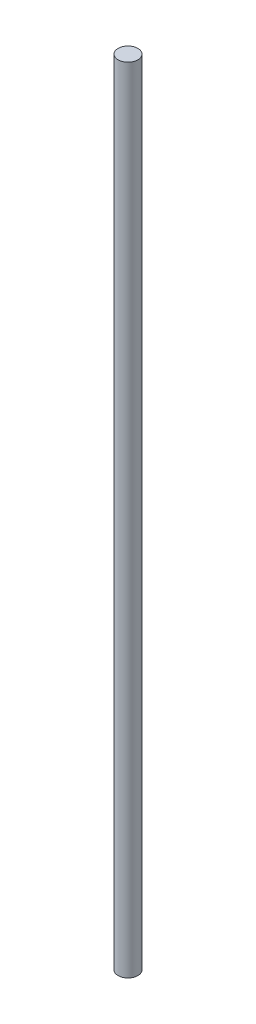
ISO-10303-21;
HEADER;
FILE_DESCRIPTION(('STEP AP214'),'2;1');
FILE_NAME('part.step','',(''),(''),'','','');
FILE_SCHEMA(('AUTOMOTIVE_DESIGN { 1 0 10303 214 1 1 1 1 }'));
ENDSEC;
DATA;
#1=APPLICATION_CONTEXT('core data for automotive mechanical design processes');
#2=APPLICATION_PROTOCOL_DEFINITION('international standard','automotive_design',2000,#1);
#3=PRODUCT_CONTEXT('',#1,'mechanical');
#4=PRODUCT('Part','Part','',(#3));
#5=PRODUCT_RELATED_PRODUCT_CATEGORY('part','',(#4));
#6=PRODUCT_DEFINITION_FORMATION('','',#4);
#7=PRODUCT_DEFINITION_CONTEXT('part definition',#1,'design');
#8=PRODUCT_DEFINITION('design','',#6,#7);
#9=PRODUCT_DEFINITION_SHAPE('','',#8);
#10=(LENGTH_UNIT() NAMED_UNIT(*) SI_UNIT(.MILLI.,.METRE.));
#11=(NAMED_UNIT(*) PLANE_ANGLE_UNIT() SI_UNIT($,.RADIAN.));
#12=(NAMED_UNIT(*) SI_UNIT($,.STERADIAN.) SOLID_ANGLE_UNIT());
#13=UNCERTAINTY_MEASURE_WITH_UNIT(LENGTH_MEASURE(1.E-05),#10,'distance_accuracy_value','');
#14=(GEOMETRIC_REPRESENTATION_CONTEXT(3) GLOBAL_UNCERTAINTY_ASSIGNED_CONTEXT((#13)) GLOBAL_UNIT_ASSIGNED_CONTEXT((#10,
#11,#12)) REPRESENTATION_CONTEXT('',''));
#15=CARTESIAN_POINT('',(0.,0.,0.));
#16=DIRECTION('',(0.,0.,1.));
#17=DIRECTION('',(1.,0.,0.));
#18=AXIS2_PLACEMENT_3D('',#15,#16,#17);
#19=CARTESIAN_POINT('',(0.,508.,0.));
#20=DIRECTION('',(0.,-1.,0.));
#21=DIRECTION('',(0.,0.,-1.));
#22=AXIS2_PLACEMENT_3D('',#19,#20,#21);
#23=CYLINDRICAL_SURFACE('',#22,6.35);
#24=CARTESIAN_POINT('',(0.,508.,0.));
#25=DIRECTION('',(0.,1.,0.));
#26=DIRECTION('',(0.,0.,1.));
#27=AXIS2_PLACEMENT_3D('',#24,#25,#26);
#28=CIRCLE('',#27,6.35);
#29=CARTESIAN_POINT('',(0.,508.,6.35));
#30=VERTEX_POINT('',#29);
#31=EDGE_CURVE('E10',#30,#30,#28,.T.);
#32=ORIENTED_EDGE('',*,*,#31,.F.);
#33=EDGE_LOOP('',(#32));
#34=FACE_BOUND('',#33,.T.);
#35=CARTESIAN_POINT('',(0.,0.,0.));
#36=DIRECTION('',(0.,1.,0.));
#37=DIRECTION('',(0.,0.,1.));
#38=AXIS2_PLACEMENT_3D('',#35,#36,#37);
#39=CIRCLE('',#38,6.35);
#40=CARTESIAN_POINT('',(0.,0.,6.35));
#41=VERTEX_POINT('',#40);
#42=EDGE_CURVE('E37',#41,#41,#39,.T.);
#43=ORIENTED_EDGE('',*,*,#42,.T.);
#44=EDGE_LOOP('',(#43));
#45=FACE_BOUND('',#44,.T.);
#46=ADVANCED_FACE('F34',(#34,#45),#23,.T.);
#47=CARTESIAN_POINT('',(0.,508.,0.));
#48=DIRECTION('',(0.,1.,0.));
#49=DIRECTION('',(0.,0.,1.));
#50=AXIS2_PLACEMENT_3D('',#47,#48,#49);
#51=PLANE('',#50);
#52=ORIENTED_EDGE('',*,*,#31,.T.);
#53=EDGE_LOOP('',(#52));
#54=FACE_BOUND('',#53,.T.);
#55=ADVANCED_FACE('F49',(#54),#51,.T.);
#56=CARTESIAN_POINT('',(0.,0.,0.));
#57=DIRECTION('',(0.,1.,0.));
#58=DIRECTION('',(0.,0.,1.));
#59=AXIS2_PLACEMENT_3D('',#56,#57,#58);
#60=PLANE('',#59);
#61=ORIENTED_EDGE('',*,*,#42,.F.);
#62=EDGE_LOOP('',(#61));
#63=FACE_BOUND('',#62,.T.);
#64=ADVANCED_FACE('F47',(#63),#60,.F.);
#65=CLOSED_SHELL('',(#46,#55,#64));
#66=MANIFOLD_SOLID_BREP('B2',#65);
#67=ADVANCED_BREP_SHAPE_REPRESENTATION('',(#18,#66),#14);
#68=SHAPE_DEFINITION_REPRESENTATION(#9,#67);
ENDSEC;
END-ISO-10303-21;
